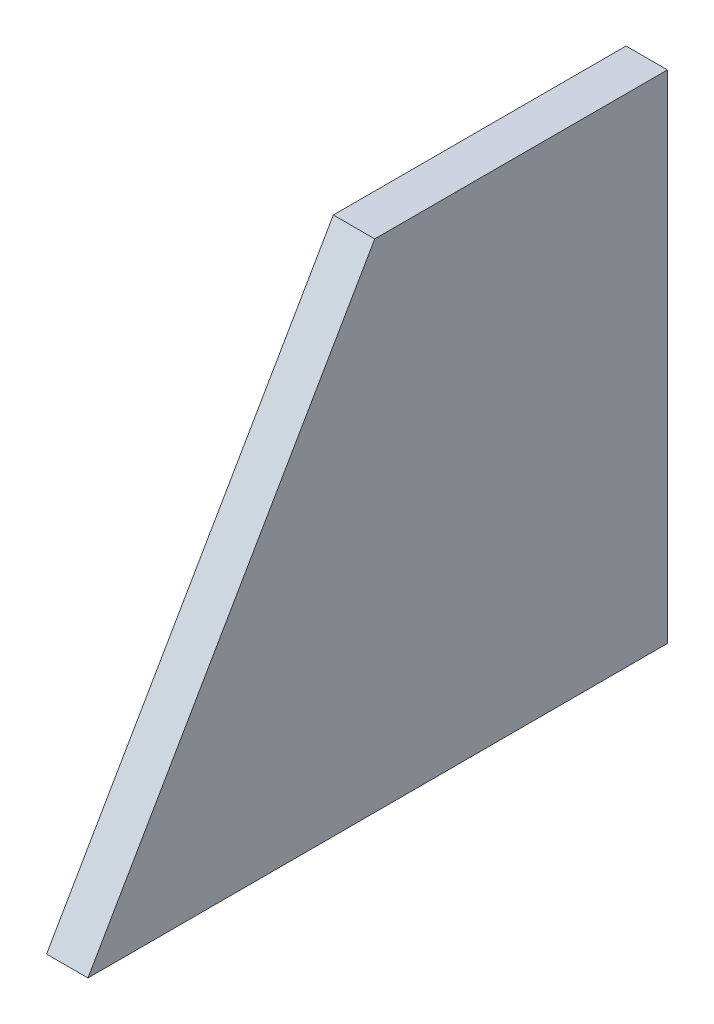
ISO-10303-21;
HEADER;
FILE_DESCRIPTION(('STEP AP214'),'2;1');
FILE_NAME('part.step','',(''),(''),'','','');
FILE_SCHEMA(('AUTOMOTIVE_DESIGN { 1 0 10303 214 1 1 1 1 }'));
ENDSEC;
DATA;
#1=APPLICATION_CONTEXT('core data for automotive mechanical design processes');
#2=APPLICATION_PROTOCOL_DEFINITION('international standard','automotive_design',2000,#1);
#3=PRODUCT_CONTEXT('',#1,'mechanical');
#4=PRODUCT('Part','Part','',(#3));
#5=PRODUCT_RELATED_PRODUCT_CATEGORY('part','',(#4));
#6=PRODUCT_DEFINITION_FORMATION('','',#4);
#7=PRODUCT_DEFINITION_CONTEXT('part definition',#1,'design');
#8=PRODUCT_DEFINITION('design','',#6,#7);
#9=PRODUCT_DEFINITION_SHAPE('','',#8);
#10=(LENGTH_UNIT() NAMED_UNIT(*) SI_UNIT(.MILLI.,.METRE.));
#11=(NAMED_UNIT(*) PLANE_ANGLE_UNIT() SI_UNIT($,.RADIAN.));
#12=(NAMED_UNIT(*) SI_UNIT($,.STERADIAN.) SOLID_ANGLE_UNIT());
#13=UNCERTAINTY_MEASURE_WITH_UNIT(LENGTH_MEASURE(1.E-05),#10,'distance_accuracy_value','');
#14=(GEOMETRIC_REPRESENTATION_CONTEXT(3) GLOBAL_UNCERTAINTY_ASSIGNED_CONTEXT((#13)) GLOBAL_UNIT_ASSIGNED_CONTEXT((#10,
#11,#12)) REPRESENTATION_CONTEXT('',''));
#15=CARTESIAN_POINT('',(0.,0.,0.));
#16=DIRECTION('',(0.,0.,1.));
#17=DIRECTION('',(1.,0.,0.));
#18=AXIS2_PLACEMENT_3D('',#15,#16,#17);
#19=CARTESIAN_POINT('',(-295.,5.,-135.));
#20=DIRECTION('',(0.,0.,-1.));
#21=DIRECTION('',(-1.,0.,0.));
#22=AXIS2_PLACEMENT_3D('',#19,#20,#21);
#23=PLANE('',#22);
#24=DIRECTION('',(0.,-1.,0.));
#25=VECTOR('',#24,1.);
#26=CARTESIAN_POINT('',(-300.,5.,-135.));
#27=LINE('',#26,#25);
#28=CARTESIAN_POINT('',(-300.,65.,-135.));
#29=VERTEX_POINT('',#28);
#30=CARTESIAN_POINT('',(-300.,5.,-135.));
#31=VERTEX_POINT('',#30);
#32=EDGE_CURVE('E96',#29,#31,#27,.T.);
#33=ORIENTED_EDGE('',*,*,#32,.F.);
#34=DIRECTION('',(-1.,0.,0.));
#35=VECTOR('',#34,1.);
#36=CARTESIAN_POINT('',(-295.,65.,-135.));
#37=LINE('',#36,#35);
#38=CARTESIAN_POINT('',(-295.,65.,-135.));
#39=VERTEX_POINT('',#38);
#40=EDGE_CURVE('E11',#39,#29,#37,.T.);
#41=ORIENTED_EDGE('',*,*,#40,.F.);
#42=DIRECTION('',(0.,-1.,0.));
#43=VECTOR('',#42,1.);
#44=CARTESIAN_POINT('',(-295.,5.,-135.));
#45=LINE('',#44,#43);
#46=CARTESIAN_POINT('',(-295.,5.,-135.));
#47=VERTEX_POINT('',#46);
#48=EDGE_CURVE('E90',#39,#47,#45,.T.);
#49=ORIENTED_EDGE('',*,*,#48,.T.);
#50=DIRECTION('',(-1.,0.,0.));
#51=VECTOR('',#50,1.);
#52=CARTESIAN_POINT('',(-295.,5.,-135.));
#53=LINE('',#52,#51);
#54=EDGE_CURVE('E35',#47,#31,#53,.T.);
#55=ORIENTED_EDGE('',*,*,#54,.T.);
#56=EDGE_LOOP('',(#33,#41,#49,#55));
#57=FACE_BOUND('',#56,.T.);
#58=ADVANCED_FACE('F32',(#57),#23,.T.);
#59=CARTESIAN_POINT('',(-295.,65.,-135.));
#60=DIRECTION('',(0.,1.,0.));
#61=DIRECTION('',(0.,0.,1.));
#62=AXIS2_PLACEMENT_3D('',#59,#60,#61);
#63=PLANE('',#62);
#64=DIRECTION('',(0.,0.,-1.));
#65=VECTOR('',#64,1.);
#66=CARTESIAN_POINT('',(-300.,65.,-135.));
#67=LINE('',#66,#65);
#68=CARTESIAN_POINT('',(-300.,65.,-99.6410161513774));
#69=VERTEX_POINT('',#68);
#70=EDGE_CURVE('E92',#69,#29,#67,.T.);
#71=ORIENTED_EDGE('',*,*,#70,.F.);
#72=DIRECTION('',(-1.,0.,0.));
#73=VECTOR('',#72,1.);
#74=CARTESIAN_POINT('',(-295.,65.,-99.6410161513774));
#75=LINE('',#74,#73);
#76=CARTESIAN_POINT('',(-295.,65.,-99.6410161513774));
#77=VERTEX_POINT('',#76);
#78=EDGE_CURVE('E41',#77,#69,#75,.T.);
#79=ORIENTED_EDGE('',*,*,#78,.F.);
#80=DIRECTION('',(0.,0.,-1.));
#81=VECTOR('',#80,1.);
#82=CARTESIAN_POINT('',(-295.,65.,-135.));
#83=LINE('',#82,#81);
#84=EDGE_CURVE('E87',#77,#39,#83,.T.);
#85=ORIENTED_EDGE('',*,*,#84,.T.);
#86=ORIENTED_EDGE('',*,*,#40,.T.);
#87=EDGE_LOOP('',(#71,#79,#85,#86));
#88=FACE_BOUND('',#87,.T.);
#89=ADVANCED_FACE('F106',(#88),#63,.T.);
#90=CARTESIAN_POINT('',(-295.,65.,-99.6410161513774));
#91=DIRECTION('',(0.,0.499999999999998,0.86602540378444));
#92=DIRECTION('',(0.,-0.86602540378444,0.499999999999998));
#93=AXIS2_PLACEMENT_3D('',#90,#91,#92);
#94=PLANE('',#93);
#95=DIRECTION('',(0.,0.86602540378444,-0.499999999999998));
#96=VECTOR('',#95,1.);
#97=CARTESIAN_POINT('',(-300.,65.,-99.6410161513774));
#98=LINE('',#97,#96);
#99=CARTESIAN_POINT('',(-300.,5.,-65.));
#100=VERTEX_POINT('',#99);
#101=EDGE_CURVE('E82',#100,#69,#98,.T.);
#102=ORIENTED_EDGE('',*,*,#101,.F.);
#103=DIRECTION('',(-1.,0.,0.));
#104=VECTOR('',#103,1.);
#105=CARTESIAN_POINT('',(-295.,5.,-65.));
#106=LINE('',#105,#104);
#107=CARTESIAN_POINT('',(-295.,5.,-65.));
#108=VERTEX_POINT('',#107);
#109=EDGE_CURVE('E77',#108,#100,#106,.T.);
#110=ORIENTED_EDGE('',*,*,#109,.F.);
#111=DIRECTION('',(0.,0.86602540378444,-0.499999999999998));
#112=VECTOR('',#111,1.);
#113=CARTESIAN_POINT('',(-295.,65.,-99.6410161513774));
#114=LINE('',#113,#112);
#115=EDGE_CURVE('E80',#108,#77,#114,.T.);
#116=ORIENTED_EDGE('',*,*,#115,.T.);
#117=ORIENTED_EDGE('',*,*,#78,.T.);
#118=EDGE_LOOP('',(#102,#110,#116,#117));
#119=FACE_BOUND('',#118,.T.);
#120=ADVANCED_FACE('F79',(#119),#94,.T.);
#121=CARTESIAN_POINT('',(-295.,5.,-135.));
#122=DIRECTION('',(0.,-1.,0.));
#123=DIRECTION('',(0.,0.,-1.));
#124=AXIS2_PLACEMENT_3D('',#121,#122,#123);
#125=PLANE('',#124);
#126=DIRECTION('',(0.,0.,1.));
#127=VECTOR('',#126,1.);
#128=CARTESIAN_POINT('',(-300.,5.,-135.));
#129=LINE('',#128,#127);
#130=EDGE_CURVE('E99',#31,#100,#129,.T.);
#131=ORIENTED_EDGE('',*,*,#130,.F.);
#132=ORIENTED_EDGE('',*,*,#54,.F.);
#133=DIRECTION('',(0.,0.,1.));
#134=VECTOR('',#133,1.);
#135=CARTESIAN_POINT('',(-295.,5.,-135.));
#136=LINE('',#135,#134);
#137=EDGE_CURVE('E86',#47,#108,#136,.T.);
#138=ORIENTED_EDGE('',*,*,#137,.T.);
#139=ORIENTED_EDGE('',*,*,#109,.T.);
#140=EDGE_LOOP('',(#131,#132,#138,#139));
#141=FACE_BOUND('',#140,.T.);
#142=ADVANCED_FACE('F89',(#141),#125,.T.);
#143=CARTESIAN_POINT('',(-295.,0.,0.));
#144=DIRECTION('',(1.,0.,0.));
#145=DIRECTION('',(0.,0.,-1.));
#146=AXIS2_PLACEMENT_3D('',#143,#144,#145);
#147=PLANE('',#146);
#148=ORIENTED_EDGE('',*,*,#48,.F.);
#149=ORIENTED_EDGE('',*,*,#84,.F.);
#150=ORIENTED_EDGE('',*,*,#115,.F.);
#151=ORIENTED_EDGE('',*,*,#137,.F.);
#152=EDGE_LOOP('',(#148,#149,#150,#151));
#153=FACE_BOUND('',#152,.T.);
#154=ADVANCED_FACE('F85',(#153),#147,.T.);
#155=CARTESIAN_POINT('',(-300.,0.,0.));
#156=DIRECTION('',(1.,0.,0.));
#157=DIRECTION('',(0.,0.,-1.));
#158=AXIS2_PLACEMENT_3D('',#155,#156,#157);
#159=PLANE('',#158);
#160=ORIENTED_EDGE('',*,*,#32,.T.);
#161=ORIENTED_EDGE('',*,*,#130,.T.);
#162=ORIENTED_EDGE('',*,*,#101,.T.);
#163=ORIENTED_EDGE('',*,*,#70,.T.);
#164=EDGE_LOOP('',(#160,#161,#162,#163));
#165=FACE_BOUND('',#164,.T.);
#166=ADVANCED_FACE('F105',(#165),#159,.F.);
#167=CLOSED_SHELL('',(#58,#89,#120,#142,#154,#166));
#168=MANIFOLD_SOLID_BREP('B2',#167);
#169=ADVANCED_BREP_SHAPE_REPRESENTATION('',(#18,#168),#14);
#170=SHAPE_DEFINITION_REPRESENTATION(#9,#169);
ENDSEC;
END-ISO-10303-21;
